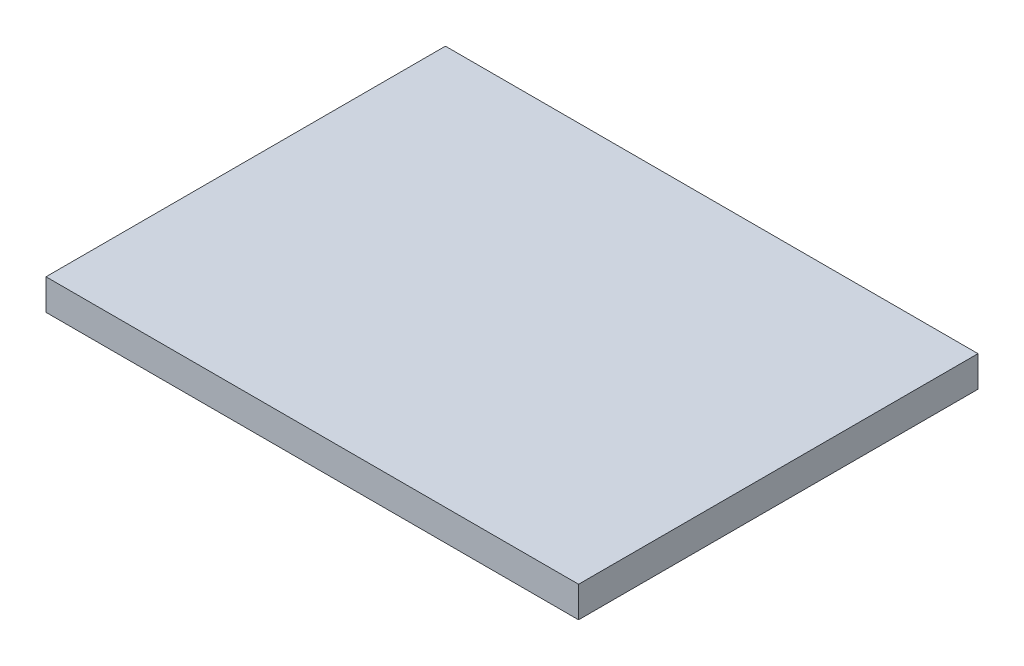
ISO-10303-21;
HEADER;
FILE_DESCRIPTION(('STEP AP214'),'2;1');
FILE_NAME('part.step','',(''),(''),'','','');
FILE_SCHEMA(('AUTOMOTIVE_DESIGN { 1 0 10303 214 1 1 1 1 }'));
ENDSEC;
DATA;
#1=APPLICATION_CONTEXT('core data for automotive mechanical design processes');
#2=APPLICATION_PROTOCOL_DEFINITION('international standard','automotive_design',2000,#1);
#3=PRODUCT_CONTEXT('',#1,'mechanical');
#4=PRODUCT('Part','Part','',(#3));
#5=PRODUCT_RELATED_PRODUCT_CATEGORY('part','',(#4));
#6=PRODUCT_DEFINITION_FORMATION('','',#4);
#7=PRODUCT_DEFINITION_CONTEXT('part definition',#1,'design');
#8=PRODUCT_DEFINITION('design','',#6,#7);
#9=PRODUCT_DEFINITION_SHAPE('','',#8);
#10=(LENGTH_UNIT() NAMED_UNIT(*) SI_UNIT(.MILLI.,.METRE.));
#11=(NAMED_UNIT(*) PLANE_ANGLE_UNIT() SI_UNIT($,.RADIAN.));
#12=(NAMED_UNIT(*) SI_UNIT($,.STERADIAN.) SOLID_ANGLE_UNIT());
#13=UNCERTAINTY_MEASURE_WITH_UNIT(LENGTH_MEASURE(1.E-05),#10,'distance_accuracy_value','');
#14=(GEOMETRIC_REPRESENTATION_CONTEXT(3) GLOBAL_UNCERTAINTY_ASSIGNED_CONTEXT((#13)) GLOBAL_UNIT_ASSIGNED_CONTEXT((#10,
#11,#12)) REPRESENTATION_CONTEXT('',''));
#15=CARTESIAN_POINT('',(0.,0.,0.));
#16=DIRECTION('',(0.,0.,1.));
#17=DIRECTION('',(1.,0.,0.));
#18=AXIS2_PLACEMENT_3D('',#15,#16,#17);
#19=CARTESIAN_POINT('',(0.,0.,32.));
#20=DIRECTION('',(0.,1.,0.));
#21=DIRECTION('',(0.,0.,1.));
#22=AXIS2_PLACEMENT_3D('',#19,#20,#21);
#23=PLANE('',#22);
#24=DIRECTION('',(0.,0.,1.));
#25=VECTOR('',#24,1.);
#26=CARTESIAN_POINT('',(4.06150000000001,0.,3.046));
#27=LINE('',#26,#25);
#28=CARTESIAN_POINT('',(4.06150000000001,0.,3.046));
#29=VERTEX_POINT('',#28);
#30=CARTESIAN_POINT('',(4.06150000000001,0.,28.954));
#31=VERTEX_POINT('',#30);
#32=EDGE_CURVE('E57',#29,#31,#27,.T.);
#33=ORIENTED_EDGE('',*,*,#32,.F.);
#34=DIRECTION('',(-1.,0.,0.));
#35=VECTOR('',#34,1.);
#36=CARTESIAN_POINT('',(4.06150000000001,0.,3.046));
#37=LINE('',#36,#35);
#38=CARTESIAN_POINT('',(38.6055,0.,3.046));
#39=VERTEX_POINT('',#38);
#40=EDGE_CURVE('E101',#39,#29,#37,.T.);
#41=ORIENTED_EDGE('',*,*,#40,.F.);
#42=DIRECTION('',(0.,0.,-1.));
#43=VECTOR('',#42,1.);
#44=CARTESIAN_POINT('',(38.6055,0.,3.046));
#45=LINE('',#44,#43);
#46=CARTESIAN_POINT('',(38.6055,0.,28.954));
#47=VERTEX_POINT('',#46);
#48=EDGE_CURVE('E75',#47,#39,#45,.T.);
#49=ORIENTED_EDGE('',*,*,#48,.F.);
#50=DIRECTION('',(1.,0.,0.));
#51=VECTOR('',#50,1.);
#52=CARTESIAN_POINT('',(4.06150000000001,0.,28.954));
#53=LINE('',#52,#51);
#54=EDGE_CURVE('E97',#31,#47,#53,.T.);
#55=ORIENTED_EDGE('',*,*,#54,.F.);
#56=EDGE_LOOP('',(#33,#41,#49,#55));
#57=FACE_BOUND('',#56,.T.);
#58=ADVANCED_FACE('F32',(#57),#23,.F.);
#59=CARTESIAN_POINT('',(4.06150000000001,0.,3.046));
#60=DIRECTION('',(-1.,0.,0.));
#61=DIRECTION('',(0.,0.,1.));
#62=AXIS2_PLACEMENT_3D('',#59,#60,#61);
#63=PLANE('',#62);
#64=DIRECTION('',(0.,0.,1.));
#65=VECTOR('',#64,1.);
#66=CARTESIAN_POINT('',(4.06150000000001,2.,3.046));
#67=LINE('',#66,#65);
#68=CARTESIAN_POINT('',(4.06150000000001,2.,3.046));
#69=VERTEX_POINT('',#68);
#70=CARTESIAN_POINT('',(4.06150000000001,2.,28.954));
#71=VERTEX_POINT('',#70);
#72=EDGE_CURVE('E92',#69,#71,#67,.T.);
#73=ORIENTED_EDGE('',*,*,#72,.F.);
#74=DIRECTION('',(0.,1.,0.));
#75=VECTOR('',#74,1.);
#76=CARTESIAN_POINT('',(4.06150000000001,0.,3.046));
#77=LINE('',#76,#75);
#78=EDGE_CURVE('E12',#29,#69,#77,.T.);
#79=ORIENTED_EDGE('',*,*,#78,.F.);
#80=ORIENTED_EDGE('',*,*,#32,.T.);
#81=DIRECTION('',(0.,1.,0.));
#82=VECTOR('',#81,1.);
#83=CARTESIAN_POINT('',(4.06150000000001,0.,28.954));
#84=LINE('',#83,#82);
#85=EDGE_CURVE('E36',#31,#71,#84,.T.);
#86=ORIENTED_EDGE('',*,*,#85,.T.);
#87=EDGE_LOOP('',(#73,#79,#80,#86));
#88=FACE_BOUND('',#87,.T.);
#89=ADVANCED_FACE('F103',(#88),#63,.T.);
#90=CARTESIAN_POINT('',(4.06150000000001,0.,3.046));
#91=DIRECTION('',(0.,0.,-1.));
#92=DIRECTION('',(-1.,0.,0.));
#93=AXIS2_PLACEMENT_3D('',#90,#91,#92);
#94=PLANE('',#93);
#95=DIRECTION('',(-1.,0.,0.));
#96=VECTOR('',#95,1.);
#97=CARTESIAN_POINT('',(4.06150000000001,2.,3.046));
#98=LINE('',#97,#96);
#99=CARTESIAN_POINT('',(38.6055,2.,3.046));
#100=VERTEX_POINT('',#99);
#101=EDGE_CURVE('E82',#100,#69,#98,.T.);
#102=ORIENTED_EDGE('',*,*,#101,.F.);
#103=DIRECTION('',(0.,1.,0.));
#104=VECTOR('',#103,1.);
#105=CARTESIAN_POINT('',(38.6055,0.,3.046));
#106=LINE('',#105,#104);
#107=EDGE_CURVE('E41',#39,#100,#106,.T.);
#108=ORIENTED_EDGE('',*,*,#107,.F.);
#109=ORIENTED_EDGE('',*,*,#40,.T.);
#110=ORIENTED_EDGE('',*,*,#78,.T.);
#111=EDGE_LOOP('',(#102,#108,#109,#110));
#112=FACE_BOUND('',#111,.T.);
#113=ADVANCED_FACE('F83',(#112),#94,.T.);
#114=CARTESIAN_POINT('',(38.6055,0.,3.046));
#115=DIRECTION('',(1.,0.,0.));
#116=DIRECTION('',(0.,0.,-1.));
#117=AXIS2_PLACEMENT_3D('',#114,#115,#116);
#118=PLANE('',#117);
#119=DIRECTION('',(0.,0.,-1.));
#120=VECTOR('',#119,1.);
#121=CARTESIAN_POINT('',(38.6055,2.,3.046));
#122=LINE('',#121,#120);
#123=CARTESIAN_POINT('',(38.6055,2.,28.954));
#124=VERTEX_POINT('',#123);
#125=EDGE_CURVE('E49',#124,#100,#122,.T.);
#126=ORIENTED_EDGE('',*,*,#125,.F.);
#127=DIRECTION('',(0.,1.,0.));
#128=VECTOR('',#127,1.);
#129=CARTESIAN_POINT('',(38.6055,0.,28.954));
#130=LINE('',#129,#128);
#131=EDGE_CURVE('E79',#47,#124,#130,.T.);
#132=ORIENTED_EDGE('',*,*,#131,.F.);
#133=ORIENTED_EDGE('',*,*,#48,.T.);
#134=ORIENTED_EDGE('',*,*,#107,.T.);
#135=EDGE_LOOP('',(#126,#132,#133,#134));
#136=FACE_BOUND('',#135,.T.);
#137=ADVANCED_FACE('F73',(#136),#118,.T.);
#138=CARTESIAN_POINT('',(4.06150000000001,0.,28.954));
#139=DIRECTION('',(0.,0.,1.));
#140=DIRECTION('',(1.,0.,0.));
#141=AXIS2_PLACEMENT_3D('',#138,#139,#140);
#142=PLANE('',#141);
#143=DIRECTION('',(1.,0.,0.));
#144=VECTOR('',#143,1.);
#145=CARTESIAN_POINT('',(4.06150000000001,2.,28.954));
#146=LINE('',#145,#144);
#147=EDGE_CURVE('E90',#71,#124,#146,.T.);
#148=ORIENTED_EDGE('',*,*,#147,.F.);
#149=ORIENTED_EDGE('',*,*,#85,.F.);
#150=ORIENTED_EDGE('',*,*,#54,.T.);
#151=ORIENTED_EDGE('',*,*,#131,.T.);
#152=EDGE_LOOP('',(#148,#149,#150,#151));
#153=FACE_BOUND('',#152,.T.);
#154=ADVANCED_FACE('F105',(#153),#142,.T.);
#155=CARTESIAN_POINT('',(0.,2.,32.));
#156=DIRECTION('',(0.,1.,0.));
#157=DIRECTION('',(0.,0.,1.));
#158=AXIS2_PLACEMENT_3D('',#155,#156,#157);
#159=PLANE('',#158);
#160=ORIENTED_EDGE('',*,*,#101,.T.);
#161=ORIENTED_EDGE('',*,*,#72,.T.);
#162=ORIENTED_EDGE('',*,*,#147,.T.);
#163=ORIENTED_EDGE('',*,*,#125,.T.);
#164=EDGE_LOOP('',(#160,#161,#162,#163));
#165=FACE_BOUND('',#164,.T.);
#166=ADVANCED_FACE('F34',(#165),#159,.T.);
#167=CLOSED_SHELL('',(#58,#89,#113,#137,#154,#166));
#168=MANIFOLD_SOLID_BREP('B2',#167);
#169=ADVANCED_BREP_SHAPE_REPRESENTATION('',(#18,#168),#14);
#170=SHAPE_DEFINITION_REPRESENTATION(#9,#169);
ENDSEC;
END-ISO-10303-21;
